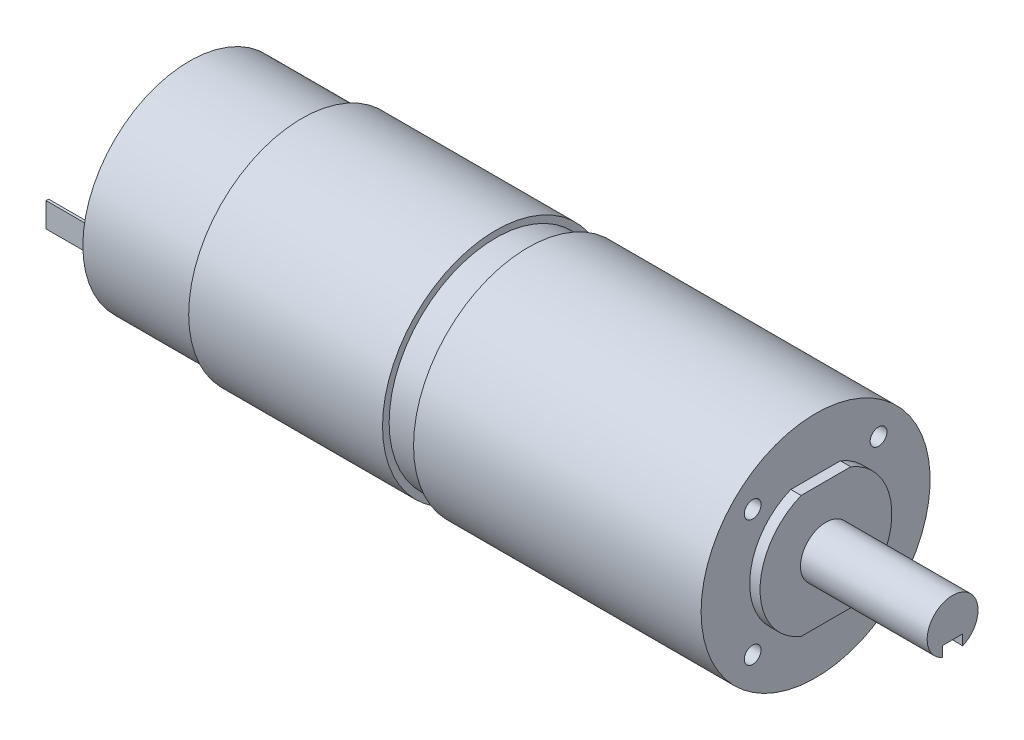
ISO-10303-21;
HEADER;
FILE_DESCRIPTION(('STEP AP214'),'2;1');
FILE_NAME('part.step','',(''),(''),'','','');
FILE_SCHEMA(('AUTOMOTIVE_DESIGN { 1 0 10303 214 1 1 1 1 }'));
ENDSEC;
DATA;
#1=APPLICATION_CONTEXT('core data for automotive mechanical design processes');
#2=APPLICATION_PROTOCOL_DEFINITION('international standard','automotive_design',2000,#1);
#3=PRODUCT_CONTEXT('',#1,'mechanical');
#4=PRODUCT('Part','Part','',(#3));
#5=PRODUCT_RELATED_PRODUCT_CATEGORY('part','',(#4));
#6=PRODUCT_DEFINITION_FORMATION('','',#4);
#7=PRODUCT_DEFINITION_CONTEXT('part definition',#1,'design');
#8=PRODUCT_DEFINITION('design','',#6,#7);
#9=PRODUCT_DEFINITION_SHAPE('','',#8);
#10=(LENGTH_UNIT() NAMED_UNIT(*) SI_UNIT(.MILLI.,.METRE.));
#11=(NAMED_UNIT(*) PLANE_ANGLE_UNIT() SI_UNIT($,.RADIAN.));
#12=(NAMED_UNIT(*) SI_UNIT($,.STERADIAN.) SOLID_ANGLE_UNIT());
#13=UNCERTAINTY_MEASURE_WITH_UNIT(LENGTH_MEASURE(1.E-05),#10,'distance_accuracy_value','');
#14=(GEOMETRIC_REPRESENTATION_CONTEXT(3) GLOBAL_UNCERTAINTY_ASSIGNED_CONTEXT((#13)) GLOBAL_UNIT_ASSIGNED_CONTEXT((#10,
#11,#12)) REPRESENTATION_CONTEXT('',''));
#15=CARTESIAN_POINT('',(0.,0.,0.));
#16=DIRECTION('',(0.,0.,1.));
#17=DIRECTION('',(1.,0.,0.));
#18=AXIS2_PLACEMENT_3D('',#15,#16,#17);
#19=CARTESIAN_POINT('',(9.01699999999997,11.43,0.));
#20=DIRECTION('',(1.,0.,0.));
#21=DIRECTION('',(0.,0.,-1.));
#22=AXIS2_PLACEMENT_3D('',#19,#20,#21);
#23=PLANE('',#22);
#24=DIRECTION('',(0.,1.,0.));
#25=VECTOR('',#24,1.);
#26=CARTESIAN_POINT('',(9.01699999999997,2.413,18.796));
#27=LINE('',#26,#25);
#28=CARTESIAN_POINT('',(9.01699999999997,-2.413,18.796));
#29=VERTEX_POINT('',#28);
#30=CARTESIAN_POINT('',(9.01699999999997,2.413,18.796));
#31=VERTEX_POINT('',#30);
#32=EDGE_CURVE('E186',#29,#31,#27,.T.);
#33=ORIENTED_EDGE('',*,*,#32,.T.);
#34=DIRECTION('',(0.,0.,1.));
#35=VECTOR('',#34,1.);
#36=CARTESIAN_POINT('',(9.01699999999997,2.413,18.796));
#37=LINE('',#36,#35);
#38=CARTESIAN_POINT('',(9.01699999999997,2.413,19.304));
#39=VERTEX_POINT('',#38);
#40=EDGE_CURVE('E197',#31,#39,#37,.T.);
#41=ORIENTED_EDGE('',*,*,#40,.T.);
#42=DIRECTION('',(0.,1.,0.));
#43=VECTOR('',#42,1.);
#44=CARTESIAN_POINT('',(9.01699999999997,2.413,19.304));
#45=LINE('',#44,#43);
#46=CARTESIAN_POINT('',(9.01699999999997,-2.413,19.304));
#47=VERTEX_POINT('',#46);
#48=EDGE_CURVE('E181',#47,#39,#45,.T.);
#49=ORIENTED_EDGE('',*,*,#48,.F.);
#50=DIRECTION('',(0.,0.,1.));
#51=VECTOR('',#50,1.);
#52=CARTESIAN_POINT('',(9.01699999999997,-2.413,18.796));
#53=LINE('',#52,#51);
#54=EDGE_CURVE('E201',#29,#47,#53,.T.);
#55=ORIENTED_EDGE('',*,*,#54,.F.);
#56=EDGE_LOOP('',(#33,#41,#49,#55));
#57=FACE_BOUND('',#56,.T.);
#58=CARTESIAN_POINT('',(9.01699999999997,0.,0.));
#59=DIRECTION('',(-1.,0.,0.));
#60=DIRECTION('',(0.,0.,1.));
#61=AXIS2_PLACEMENT_3D('',#58,#59,#60);
#62=CIRCLE('',#61,11.43);
#63=CARTESIAN_POINT('',(9.01699999999997,0.,11.43));
#64=VERTEX_POINT('',#63);
#65=EDGE_CURVE('E317',#64,#64,#62,.T.);
#66=ORIENTED_EDGE('',*,*,#65,.F.);
#67=EDGE_LOOP('',(#66));
#68=FACE_BOUND('',#67,.T.);
#69=CARTESIAN_POINT('',(9.01699999999997,0.,0.));
#70=DIRECTION('',(-1.,0.,0.));
#71=DIRECTION('',(0.,0.,1.));
#72=AXIS2_PLACEMENT_3D('',#69,#70,#71);
#73=CIRCLE('',#72,20.955);
#74=CARTESIAN_POINT('',(9.01699999999997,0.,20.955));
#75=VERTEX_POINT('',#74);
#76=EDGE_CURVE('E314',#75,#75,#73,.T.);
#77=ORIENTED_EDGE('',*,*,#76,.T.);
#78=EDGE_LOOP('',(#77));
#79=FACE_BOUND('',#78,.T.);
#80=DIRECTION('',(0.,1.,0.));
#81=VECTOR('',#80,1.);
#82=CARTESIAN_POINT('',(9.01699999999997,2.413,-18.796));
#83=LINE('',#82,#81);
#84=CARTESIAN_POINT('',(9.01699999999997,-2.413,-18.796));
#85=VERTEX_POINT('',#84);
#86=CARTESIAN_POINT('',(9.01699999999997,2.413,-18.796));
#87=VERTEX_POINT('',#86);
#88=EDGE_CURVE('E148',#85,#87,#83,.T.);
#89=ORIENTED_EDGE('',*,*,#88,.F.);
#90=DIRECTION('',(0.,0.,-1.));
#91=VECTOR('',#90,1.);
#92=CARTESIAN_POINT('',(9.01699999999997,-2.413,-18.796));
#93=LINE('',#92,#91);
#94=CARTESIAN_POINT('',(9.01699999999997,-2.413,-19.304));
#95=VERTEX_POINT('',#94);
#96=EDGE_CURVE('E169',#85,#95,#93,.T.);
#97=ORIENTED_EDGE('',*,*,#96,.T.);
#98=DIRECTION('',(0.,1.,0.));
#99=VECTOR('',#98,1.);
#100=CARTESIAN_POINT('',(9.01699999999997,2.413,-19.304));
#101=LINE('',#100,#99);
#102=CARTESIAN_POINT('',(9.01699999999997,2.413,-19.304));
#103=VERTEX_POINT('',#102);
#104=EDGE_CURVE('E168',#95,#103,#101,.T.);
#105=ORIENTED_EDGE('',*,*,#104,.T.);
#106=DIRECTION('',(0.,0.,-1.));
#107=VECTOR('',#106,1.);
#108=CARTESIAN_POINT('',(9.01699999999997,2.413,-18.796));
#109=LINE('',#108,#107);
#110=EDGE_CURVE('E162',#87,#103,#109,.T.);
#111=ORIENTED_EDGE('',*,*,#110,.F.);
#112=EDGE_LOOP('',(#89,#97,#105,#111));
#113=FACE_BOUND('',#112,.T.);
#114=ADVANCED_FACE('F32',(#57,#68,#79,#113),#23,.F.);
#115=CARTESIAN_POINT('',(0.,0.,0.));
#116=DIRECTION('',(-1.,0.,0.));
#117=DIRECTION('',(0.,0.,1.));
#118=AXIS2_PLACEMENT_3D('',#115,#116,#117);
#119=CYLINDRICAL_SURFACE('',#118,12.954);
#120=CARTESIAN_POINT('',(134.112,0.,0.));
#121=DIRECTION('',(-1.,0.,0.));
#122=DIRECTION('',(0.,0.,1.));
#123=AXIS2_PLACEMENT_3D('',#120,#121,#122);
#124=CIRCLE('',#123,12.954);
#125=CARTESIAN_POINT('',(134.112,12.0015,-4.87546036287857));
#126=VERTEX_POINT('',#125);
#127=CARTESIAN_POINT('',(134.112,-12.0015,-4.87546036287857));
#128=VERTEX_POINT('',#127);
#129=EDGE_CURVE('E286',#126,#128,#124,.T.);
#130=ORIENTED_EDGE('',*,*,#129,.T.);
#131=DIRECTION('',(1.,0.,0.));
#132=VECTOR('',#131,1.);
#133=CARTESIAN_POINT('',(122.282668156585,-12.0015,-4.87546036287857));
#134=LINE('',#133,#132);
#135=CARTESIAN_POINT('',(132.08,-12.0015,-4.87546036287857));
#136=VERTEX_POINT('',#135);
#137=EDGE_CURVE('E237',#136,#128,#134,.T.);
#138=ORIENTED_EDGE('',*,*,#137,.F.);
#139=CARTESIAN_POINT('',(132.08,0.,0.));
#140=DIRECTION('',(-1.,0.,0.));
#141=DIRECTION('',(0.,0.,1.));
#142=AXIS2_PLACEMENT_3D('',#139,#140,#141);
#143=CIRCLE('',#142,12.954);
#144=CARTESIAN_POINT('',(132.08,12.0015,-4.87546036287857));
#145=VERTEX_POINT('',#144);
#146=EDGE_CURVE('E290',#145,#136,#143,.T.);
#147=ORIENTED_EDGE('',*,*,#146,.F.);
#148=DIRECTION('',(1.,0.,0.));
#149=VECTOR('',#148,1.);
#150=CARTESIAN_POINT('',(122.282668156585,12.0015,-4.87546036287857));
#151=LINE('',#150,#149);
#152=EDGE_CURVE('E244',#145,#126,#151,.T.);
#153=ORIENTED_EDGE('',*,*,#152,.T.);
#154=EDGE_LOOP('',(#130,#138,#147,#153));
#155=FACE_BOUND('',#154,.T.);
#156=ADVANCED_FACE('F342',(#155),#119,.T.);
#157=CARTESIAN_POINT('',(0.,0.,0.));
#158=DIRECTION('',(1.,0.,0.));
#159=DIRECTION('',(0.,0.,-1.));
#160=AXIS2_PLACEMENT_3D('',#157,#158,#159);
#161=PLANE('',#160);
#162=CARTESIAN_POINT('',(0.,0.,0.));
#163=DIRECTION('',(-1.,0.,0.));
#164=DIRECTION('',(0.,0.,1.));
#165=AXIS2_PLACEMENT_3D('',#162,#163,#164);
#166=CIRCLE('',#165,3.81);
#167=CARTESIAN_POINT('',(0.,0.,3.81));
#168=VERTEX_POINT('',#167);
#169=EDGE_CURVE('E11',#168,#168,#166,.T.);
#170=ORIENTED_EDGE('',*,*,#169,.T.);
#171=EDGE_LOOP('',(#170));
#172=FACE_BOUND('',#171,.T.);
#173=ADVANCED_FACE('F34',(#172),#161,.F.);
#174=CARTESIAN_POINT('',(0.,0.,0.));
#175=DIRECTION('',(-1.,0.,0.));
#176=DIRECTION('',(0.,0.,1.));
#177=AXIS2_PLACEMENT_3D('',#174,#175,#176);
#178=CYLINDRICAL_SURFACE('',#177,3.81);
#179=ORIENTED_EDGE('',*,*,#169,.F.);
#180=EDGE_LOOP('',(#179));
#181=FACE_BOUND('',#180,.T.);
#182=CARTESIAN_POINT('',(5.08,0.,0.));
#183=DIRECTION('',(-1.,0.,0.));
#184=DIRECTION('',(0.,0.,1.));
#185=AXIS2_PLACEMENT_3D('',#182,#183,#184);
#186=CIRCLE('',#185,3.81);
#187=CARTESIAN_POINT('',(5.08,0.,3.81));
#188=VERTEX_POINT('',#187);
#189=EDGE_CURVE('E40',#188,#188,#186,.T.);
#190=ORIENTED_EDGE('',*,*,#189,.T.);
#191=EDGE_LOOP('',(#190));
#192=FACE_BOUND('',#191,.T.);
#193=ADVANCED_FACE('F325',(#181,#192),#178,.T.);
#194=CARTESIAN_POINT('',(5.08,3.81,0.));
#195=DIRECTION('',(1.,0.,0.));
#196=DIRECTION('',(0.,0.,-1.));
#197=AXIS2_PLACEMENT_3D('',#194,#195,#196);
#198=PLANE('',#197);
#199=ORIENTED_EDGE('',*,*,#189,.F.);
#200=EDGE_LOOP('',(#199));
#201=FACE_BOUND('',#200,.T.);
#202=CARTESIAN_POINT('',(5.08,0.,0.));
#203=DIRECTION('',(-1.,0.,0.));
#204=DIRECTION('',(0.,0.,1.));
#205=AXIS2_PLACEMENT_3D('',#202,#203,#204);
#206=CIRCLE('',#205,11.43);
#207=CARTESIAN_POINT('',(5.08,0.,11.43));
#208=VERTEX_POINT('',#207);
#209=EDGE_CURVE('E320',#208,#208,#206,.T.);
#210=ORIENTED_EDGE('',*,*,#209,.T.);
#211=EDGE_LOOP('',(#210));
#212=FACE_BOUND('',#211,.T.);
#213=ADVANCED_FACE('F327',(#201,#212),#198,.F.);
#214=CARTESIAN_POINT('',(0.,0.,0.));
#215=DIRECTION('',(-1.,0.,0.));
#216=DIRECTION('',(0.,0.,1.));
#217=AXIS2_PLACEMENT_3D('',#214,#215,#216);
#218=CYLINDRICAL_SURFACE('',#217,11.43);
#219=ORIENTED_EDGE('',*,*,#209,.F.);
#220=EDGE_LOOP('',(#219));
#221=FACE_BOUND('',#220,.T.);
#222=ORIENTED_EDGE('',*,*,#65,.T.);
#223=EDGE_LOOP('',(#222));
#224=FACE_BOUND('',#223,.T.);
#225=ADVANCED_FACE('F330',(#221,#224),#218,.T.);
#226=CARTESIAN_POINT('',(0.,0.,0.));
#227=DIRECTION('',(-1.,0.,0.));
#228=DIRECTION('',(0.,0.,1.));
#229=AXIS2_PLACEMENT_3D('',#226,#227,#228);
#230=CYLINDRICAL_SURFACE('',#229,20.955);
#231=ORIENTED_EDGE('',*,*,#76,.F.);
#232=EDGE_LOOP('',(#231));
#233=FACE_BOUND('',#232,.T.);
#234=CARTESIAN_POINT('',(31.115,0.,0.));
#235=DIRECTION('',(-1.,0.,0.));
#236=DIRECTION('',(0.,0.,1.));
#237=AXIS2_PLACEMENT_3D('',#234,#235,#236);
#238=CIRCLE('',#237,20.955);
#239=CARTESIAN_POINT('',(31.115,0.,20.955));
#240=VERTEX_POINT('',#239);
#241=EDGE_CURVE('E311',#240,#240,#238,.T.);
#242=ORIENTED_EDGE('',*,*,#241,.T.);
#243=EDGE_LOOP('',(#242));
#244=FACE_BOUND('',#243,.T.);
#245=ADVANCED_FACE('F336',(#233,#244),#230,.T.);
#246=CARTESIAN_POINT('',(31.115,20.955,0.));
#247=DIRECTION('',(1.,0.,0.));
#248=DIRECTION('',(0.,0.,-1.));
#249=AXIS2_PLACEMENT_3D('',#246,#247,#248);
#250=PLANE('',#249);
#251=ORIENTED_EDGE('',*,*,#241,.F.);
#252=EDGE_LOOP('',(#251));
#253=FACE_BOUND('',#252,.T.);
#254=CARTESIAN_POINT('',(31.115,0.,0.));
#255=DIRECTION('',(-1.,0.,0.));
#256=DIRECTION('',(0.,0.,1.));
#257=AXIS2_PLACEMENT_3D('',#254,#255,#256);
#258=CIRCLE('',#257,22.2504);
#259=CARTESIAN_POINT('',(31.115,0.,22.2504));
#260=VERTEX_POINT('',#259);
#261=EDGE_CURVE('E308',#260,#260,#258,.T.);
#262=ORIENTED_EDGE('',*,*,#261,.T.);
#263=EDGE_LOOP('',(#262));
#264=FACE_BOUND('',#263,.T.);
#265=ADVANCED_FACE('F349',(#253,#264),#250,.F.);
#266=CARTESIAN_POINT('',(0.,0.,0.));
#267=DIRECTION('',(-1.,0.,0.));
#268=DIRECTION('',(0.,0.,1.));
#269=AXIS2_PLACEMENT_3D('',#266,#267,#268);
#270=CYLINDRICAL_SURFACE('',#269,22.2504);
#271=ORIENTED_EDGE('',*,*,#261,.F.);
#272=EDGE_LOOP('',(#271));
#273=FACE_BOUND('',#272,.T.);
#274=CARTESIAN_POINT('',(69.215,0.,0.));
#275=DIRECTION('',(-1.,0.,0.));
#276=DIRECTION('',(0.,0.,1.));
#277=AXIS2_PLACEMENT_3D('',#274,#275,#276);
#278=CIRCLE('',#277,22.2504);
#279=CARTESIAN_POINT('',(69.215,0.,22.2504));
#280=VERTEX_POINT('',#279);
#281=EDGE_CURVE('E305',#280,#280,#278,.T.);
#282=ORIENTED_EDGE('',*,*,#281,.T.);
#283=EDGE_LOOP('',(#282));
#284=FACE_BOUND('',#283,.T.);
#285=ADVANCED_FACE('F355',(#273,#284),#270,.T.);
#286=CARTESIAN_POINT('',(69.215,22.2504,0.));
#287=DIRECTION('',(-1.,0.,0.));
#288=DIRECTION('',(0.,0.,1.));
#289=AXIS2_PLACEMENT_3D('',#286,#287,#288);
#290=PLANE('',#289);
#291=ORIENTED_EDGE('',*,*,#281,.F.);
#292=EDGE_LOOP('',(#291));
#293=FACE_BOUND('',#292,.T.);
#294=CARTESIAN_POINT('',(69.215,0.,0.));
#295=DIRECTION('',(-1.,0.,0.));
#296=DIRECTION('',(0.,0.,1.));
#297=AXIS2_PLACEMENT_3D('',#294,#295,#296);
#298=CIRCLE('',#297,20.955);
#299=CARTESIAN_POINT('',(69.215,0.,20.955));
#300=VERTEX_POINT('',#299);
#301=EDGE_CURVE('E302',#300,#300,#298,.T.);
#302=ORIENTED_EDGE('',*,*,#301,.T.);
#303=EDGE_LOOP('',(#302));
#304=FACE_BOUND('',#303,.T.);
#305=ADVANCED_FACE('F361',(#293,#304),#290,.F.);
#306=CARTESIAN_POINT('',(0.,0.,0.));
#307=DIRECTION('',(-1.,0.,0.));
#308=DIRECTION('',(0.,0.,1.));
#309=AXIS2_PLACEMENT_3D('',#306,#307,#308);
#310=CYLINDRICAL_SURFACE('',#309,20.955);
#311=ORIENTED_EDGE('',*,*,#301,.F.);
#312=EDGE_LOOP('',(#311));
#313=FACE_BOUND('',#312,.T.);
#314=CARTESIAN_POINT('',(75.565,0.,0.));
#315=DIRECTION('',(-1.,0.,0.));
#316=DIRECTION('',(0.,0.,1.));
#317=AXIS2_PLACEMENT_3D('',#314,#315,#316);
#318=CIRCLE('',#317,20.955);
#319=CARTESIAN_POINT('',(75.565,0.,20.955));
#320=VERTEX_POINT('',#319);
#321=EDGE_CURVE('E299',#320,#320,#318,.T.);
#322=ORIENTED_EDGE('',*,*,#321,.T.);
#323=EDGE_LOOP('',(#322));
#324=FACE_BOUND('',#323,.T.);
#325=ADVANCED_FACE('F367',(#313,#324),#310,.T.);
#326=CARTESIAN_POINT('',(75.565,20.955,0.));
#327=DIRECTION('',(1.,0.,0.));
#328=DIRECTION('',(0.,0.,-1.));
#329=AXIS2_PLACEMENT_3D('',#326,#327,#328);
#330=PLANE('',#329);
#331=ORIENTED_EDGE('',*,*,#321,.F.);
#332=EDGE_LOOP('',(#331));
#333=FACE_BOUND('',#332,.T.);
#334=CARTESIAN_POINT('',(75.565,0.,0.));
#335=DIRECTION('',(-1.,0.,0.));
#336=DIRECTION('',(0.,0.,1.));
#337=AXIS2_PLACEMENT_3D('',#334,#335,#336);
#338=CIRCLE('',#337,22.5044);
#339=CARTESIAN_POINT('',(75.565,0.,22.5044));
#340=VERTEX_POINT('',#339);
#341=EDGE_CURVE('E296',#340,#340,#338,.T.);
#342=ORIENTED_EDGE('',*,*,#341,.T.);
#343=EDGE_LOOP('',(#342));
#344=FACE_BOUND('',#343,.T.);
#345=ADVANCED_FACE('F373',(#333,#344),#330,.F.);
#346=CARTESIAN_POINT('',(0.,0.,0.));
#347=DIRECTION('',(-1.,0.,0.));
#348=DIRECTION('',(0.,0.,1.));
#349=AXIS2_PLACEMENT_3D('',#346,#347,#348);
#350=CYLINDRICAL_SURFACE('',#349,22.5044);
#351=ORIENTED_EDGE('',*,*,#341,.F.);
#352=EDGE_LOOP('',(#351));
#353=FACE_BOUND('',#352,.T.);
#354=CARTESIAN_POINT('',(132.08,0.,0.));
#355=DIRECTION('',(-1.,0.,0.));
#356=DIRECTION('',(0.,0.,1.));
#357=AXIS2_PLACEMENT_3D('',#354,#355,#356);
#358=CIRCLE('',#357,22.5044);
#359=CARTESIAN_POINT('',(132.08,0.,22.5044));
#360=VERTEX_POINT('',#359);
#361=EDGE_CURVE('E293',#360,#360,#358,.T.);
#362=ORIENTED_EDGE('',*,*,#361,.T.);
#363=EDGE_LOOP('',(#362));
#364=FACE_BOUND('',#363,.T.);
#365=ADVANCED_FACE('F379',(#353,#364),#350,.T.);
#366=CARTESIAN_POINT('',(132.08,22.5044,0.));
#367=DIRECTION('',(-1.,0.,0.));
#368=DIRECTION('',(0.,0.,1.));
#369=AXIS2_PLACEMENT_3D('',#366,#367,#368);
#370=PLANE('',#369);
#371=CARTESIAN_POINT('',(132.08,12.3747929348333,12.3747929348333));
#372=DIRECTION('',(1.,0.,0.));
#373=DIRECTION('',(0.,0.,-1.));
#374=AXIS2_PLACEMENT_3D('',#371,#372,#373);
#375=CIRCLE('',#374,1.65);
#376=CARTESIAN_POINT('',(132.08,12.3747929348333,10.7247929348333));
#377=VERTEX_POINT('',#376);
#378=EDGE_CURVE('E200',#377,#377,#375,.T.);
#379=ORIENTED_EDGE('',*,*,#378,.F.);
#380=EDGE_LOOP('',(#379));
#381=FACE_BOUND('',#380,.T.);
#382=CARTESIAN_POINT('',(132.08,-12.3747929348333,-12.3747929348333));
#383=DIRECTION('',(1.,0.,0.));
#384=DIRECTION('',(0.,0.,-1.));
#385=AXIS2_PLACEMENT_3D('',#382,#383,#384);
#386=CIRCLE('',#385,1.65);
#387=CARTESIAN_POINT('',(132.08,-12.3747929348333,-14.0247929348333));
#388=VERTEX_POINT('',#387);
#389=EDGE_CURVE('E211',#388,#388,#386,.T.);
#390=ORIENTED_EDGE('',*,*,#389,.F.);
#391=EDGE_LOOP('',(#390));
#392=FACE_BOUND('',#391,.T.);
#393=CARTESIAN_POINT('',(132.08,12.3747929348333,-12.3747929348333));
#394=DIRECTION('',(1.,0.,0.));
#395=DIRECTION('',(0.,0.,-1.));
#396=AXIS2_PLACEMENT_3D('',#393,#394,#395);
#397=CIRCLE('',#396,1.65);
#398=CARTESIAN_POINT('',(132.08,12.3747929348333,-14.0247929348333));
#399=VERTEX_POINT('',#398);
#400=EDGE_CURVE('E217',#399,#399,#397,.T.);
#401=ORIENTED_EDGE('',*,*,#400,.F.);
#402=EDGE_LOOP('',(#401));
#403=FACE_BOUND('',#402,.T.);
#404=CARTESIAN_POINT('',(132.08,-12.3747929348333,12.3747929348333));
#405=DIRECTION('',(1.,0.,0.));
#406=DIRECTION('',(0.,0.,-1.));
#407=AXIS2_PLACEMENT_3D('',#404,#405,#406);
#408=CIRCLE('',#407,1.65);
#409=CARTESIAN_POINT('',(132.08,-12.3747929348333,10.7247929348333));
#410=VERTEX_POINT('',#409);
#411=EDGE_CURVE('E223',#410,#410,#408,.T.);
#412=ORIENTED_EDGE('',*,*,#411,.F.);
#413=EDGE_LOOP('',(#412));
#414=FACE_BOUND('',#413,.T.);
#415=ORIENTED_EDGE('',*,*,#361,.F.);
#416=EDGE_LOOP('',(#415));
#417=FACE_BOUND('',#416,.T.);
#418=ORIENTED_EDGE('',*,*,#146,.T.);
#419=DIRECTION('',(0.,0.,1.));
#420=VECTOR('',#419,1.);
#421=CARTESIAN_POINT('',(132.08,-12.0015,4.87546036287857));
#422=LINE('',#421,#420);
#423=CARTESIAN_POINT('',(132.08,-12.0015,4.87546036287857));
#424=VERTEX_POINT('',#423);
#425=EDGE_CURVE('E231',#136,#424,#422,.T.);
#426=ORIENTED_EDGE('',*,*,#425,.T.);
#427=CARTESIAN_POINT('',(132.08,12.0015,4.87546036287857));
#428=VERTEX_POINT('',#427);
#429=EDGE_CURVE('E289',#424,#428,#143,.T.);
#430=ORIENTED_EDGE('',*,*,#429,.T.);
#431=DIRECTION('',(0.,0.,-1.));
#432=VECTOR('',#431,1.);
#433=CARTESIAN_POINT('',(132.08,12.0015,4.87546036287857));
#434=LINE('',#433,#432);
#435=EDGE_CURVE('E241',#428,#145,#434,.T.);
#436=ORIENTED_EDGE('',*,*,#435,.T.);
#437=EDGE_LOOP('',(#418,#426,#430,#436));
#438=FACE_BOUND('',#437,.T.);
#439=ADVANCED_FACE('F385',(#381,#392,#403,#414,#417,#438),#370,.F.);
#440=ORIENTED_EDGE('',*,*,#429,.F.);
#441=DIRECTION('',(1.,0.,0.));
#442=VECTOR('',#441,1.);
#443=CARTESIAN_POINT('',(122.282668156585,-12.0015,4.87546036287857));
#444=LINE('',#443,#442);
#445=CARTESIAN_POINT('',(134.112,-12.0015,4.87546036287857));
#446=VERTEX_POINT('',#445);
#447=EDGE_CURVE('E234',#424,#446,#444,.T.);
#448=ORIENTED_EDGE('',*,*,#447,.T.);
#449=CARTESIAN_POINT('',(134.112,12.0015,4.87546036287857));
#450=VERTEX_POINT('',#449);
#451=EDGE_CURVE('E285',#446,#450,#124,.T.);
#452=ORIENTED_EDGE('',*,*,#451,.T.);
#453=DIRECTION('',(1.,0.,0.));
#454=VECTOR('',#453,1.);
#455=CARTESIAN_POINT('',(122.282668156585,12.0015,4.87546036287857));
#456=LINE('',#455,#454);
#457=EDGE_CURVE('E247',#428,#450,#456,.T.);
#458=ORIENTED_EDGE('',*,*,#457,.F.);
#459=EDGE_LOOP('',(#440,#448,#452,#458));
#460=FACE_BOUND('',#459,.T.);
#461=ADVANCED_FACE('F391',(#460),#119,.T.);
#462=CARTESIAN_POINT('',(134.112,12.954,0.));
#463=DIRECTION('',(-1.,0.,0.));
#464=DIRECTION('',(0.,0.,1.));
#465=AXIS2_PLACEMENT_3D('',#462,#463,#464);
#466=PLANE('',#465);
#467=ORIENTED_EDGE('',*,*,#451,.F.);
#468=DIRECTION('',(0.,0.,1.));
#469=VECTOR('',#468,1.);
#470=CARTESIAN_POINT('',(134.112,-12.0015,4.87546036287857));
#471=LINE('',#470,#469);
#472=EDGE_CURVE('E229',#128,#446,#471,.T.);
#473=ORIENTED_EDGE('',*,*,#472,.F.);
#474=ORIENTED_EDGE('',*,*,#129,.F.);
#475=DIRECTION('',(0.,0.,-1.));
#476=VECTOR('',#475,1.);
#477=CARTESIAN_POINT('',(134.112,12.0015,4.87546036287857));
#478=LINE('',#477,#476);
#479=EDGE_CURVE('E239',#450,#126,#478,.T.);
#480=ORIENTED_EDGE('',*,*,#479,.F.);
#481=EDGE_LOOP('',(#467,#473,#474,#480));
#482=FACE_BOUND('',#481,.T.);
#483=CARTESIAN_POINT('',(134.112,0.,0.));
#484=DIRECTION('',(-1.,0.,0.));
#485=DIRECTION('',(0.,0.,1.));
#486=AXIS2_PLACEMENT_3D('',#483,#484,#485);
#487=CIRCLE('',#486,4.99999);
#488=CARTESIAN_POINT('',(134.112,0.,4.99999));
#489=VERTEX_POINT('',#488);
#490=EDGE_CURVE('E282',#489,#489,#487,.T.);
#491=ORIENTED_EDGE('',*,*,#490,.T.);
#492=EDGE_LOOP('',(#491));
#493=FACE_BOUND('',#492,.T.);
#494=ADVANCED_FACE('F405',(#482,#493),#466,.F.);
#495=CARTESIAN_POINT('',(0.,0.,0.));
#496=DIRECTION('',(-1.,0.,0.));
#497=DIRECTION('',(0.,0.,1.));
#498=AXIS2_PLACEMENT_3D('',#495,#496,#497);
#499=CYLINDRICAL_SURFACE('',#498,4.99999);
#500=CARTESIAN_POINT('',(159.004,0.,0.));
#501=DIRECTION('',(-1.,0.,0.));
#502=DIRECTION('',(0.,0.,1.));
#503=AXIS2_PLACEMENT_3D('',#500,#501,#502);
#504=CIRCLE('',#503,4.99999);
#505=CARTESIAN_POINT('',(159.004,-4.58522221818092,1.9939));
#506=VERTEX_POINT('',#505);
#507=CARTESIAN_POINT('',(159.004,-4.58522221818093,-1.9939));
#508=VERTEX_POINT('',#507);
#509=EDGE_CURVE('E272',#506,#508,#504,.T.);
#510=ORIENTED_EDGE('',*,*,#509,.T.);
#511=DIRECTION('',(1.,0.,0.));
#512=VECTOR('',#511,1.);
#513=CARTESIAN_POINT('',(140.9954,-4.58522221818093,-1.9939));
#514=LINE('',#513,#512);
#515=CARTESIAN_POINT('',(140.9954,-4.58522221818093,-1.9939));
#516=VERTEX_POINT('',#515);
#517=EDGE_CURVE('E270',#516,#508,#514,.T.);
#518=ORIENTED_EDGE('',*,*,#517,.F.);
#519=CARTESIAN_POINT('',(140.9954,0.,0.));
#520=DIRECTION('',(1.,0.,0.));
#521=DIRECTION('',(0.,0.,-1.));
#522=AXIS2_PLACEMENT_3D('',#519,#520,#521);
#523=CIRCLE('',#522,4.99999);
#524=CARTESIAN_POINT('',(140.9954,-4.58522221818092,1.9939));
#525=VERTEX_POINT('',#524);
#526=EDGE_CURVE('E261',#525,#516,#523,.T.);
#527=ORIENTED_EDGE('',*,*,#526,.F.);
#528=DIRECTION('',(1.,0.,0.));
#529=VECTOR('',#528,1.);
#530=CARTESIAN_POINT('',(140.9954,-4.58522221818092,1.9939));
#531=LINE('',#530,#529);
#532=EDGE_CURVE('E273',#525,#506,#531,.T.);
#533=ORIENTED_EDGE('',*,*,#532,.T.);
#534=EDGE_LOOP('',(#510,#518,#527,#533));
#535=FACE_BOUND('',#534,.T.);
#536=ORIENTED_EDGE('',*,*,#490,.F.);
#537=EDGE_LOOP('',(#536));
#538=FACE_BOUND('',#537,.T.);
#539=ADVANCED_FACE('F440',(#535,#538),#499,.T.);
#540=CARTESIAN_POINT('',(159.004,4.99999,0.));
#541=DIRECTION('',(-1.,0.,0.));
#542=DIRECTION('',(0.,0.,1.));
#543=AXIS2_PLACEMENT_3D('',#540,#541,#542);
#544=PLANE('',#543);
#545=DIRECTION('',(0.,0.,1.));
#546=VECTOR('',#545,1.);
#547=CARTESIAN_POINT('',(159.004,-2.55322221818092,1.9939));
#548=LINE('',#547,#546);
#549=CARTESIAN_POINT('',(159.004,-2.55322221818092,-1.9939));
#550=VERTEX_POINT('',#549);
#551=CARTESIAN_POINT('',(159.004,-2.55322221818092,1.9939));
#552=VERTEX_POINT('',#551);
#553=EDGE_CURVE('E266',#550,#552,#548,.T.);
#554=ORIENTED_EDGE('',*,*,#553,.F.);
#555=DIRECTION('',(0.,1.,0.));
#556=VECTOR('',#555,1.);
#557=CARTESIAN_POINT('',(159.004,-4.58522221818092,-1.9939));
#558=LINE('',#557,#556);
#559=EDGE_CURVE('E250',#508,#550,#558,.T.);
#560=ORIENTED_EDGE('',*,*,#559,.F.);
#561=ORIENTED_EDGE('',*,*,#509,.F.);
#562=DIRECTION('',(0.,-1.,0.));
#563=VECTOR('',#562,1.);
#564=CARTESIAN_POINT('',(159.004,-4.58522221818092,1.9939));
#565=LINE('',#564,#563);
#566=EDGE_CURVE('E255',#552,#506,#565,.T.);
#567=ORIENTED_EDGE('',*,*,#566,.F.);
#568=EDGE_LOOP('',(#554,#560,#561,#567));
#569=FACE_BOUND('',#568,.T.);
#570=ADVANCED_FACE('F436',(#569),#544,.F.);
#571=CARTESIAN_POINT('',(140.9954,-4.58522221818092,-1.9939));
#572=DIRECTION('',(0.,0.,-1.));
#573=DIRECTION('',(-1.,0.,0.));
#574=AXIS2_PLACEMENT_3D('',#571,#572,#573);
#575=PLANE('',#574);
#576=ORIENTED_EDGE('',*,*,#559,.T.);
#577=DIRECTION('',(1.,0.,0.));
#578=VECTOR('',#577,1.);
#579=CARTESIAN_POINT('',(140.9954,-2.55322221818092,-1.9939));
#580=LINE('',#579,#578);
#581=CARTESIAN_POINT('',(140.9954,-2.55322221818092,-1.9939));
#582=VERTEX_POINT('',#581);
#583=EDGE_CURVE('E264',#582,#550,#580,.T.);
#584=ORIENTED_EDGE('',*,*,#583,.F.);
#585=DIRECTION('',(0.,1.,0.));
#586=VECTOR('',#585,1.);
#587=CARTESIAN_POINT('',(140.9954,-4.58522221818092,-1.9939));
#588=LINE('',#587,#586);
#589=EDGE_CURVE('E251',#516,#582,#588,.T.);
#590=ORIENTED_EDGE('',*,*,#589,.F.);
#591=ORIENTED_EDGE('',*,*,#517,.T.);
#592=EDGE_LOOP('',(#576,#584,#590,#591));
#593=FACE_BOUND('',#592,.T.);
#594=ADVANCED_FACE('F429',(#593),#575,.F.);
#595=CARTESIAN_POINT('',(140.9954,-4.58522221818092,1.9939));
#596=DIRECTION('',(0.,0.,1.));
#597=DIRECTION('',(1.,0.,0.));
#598=AXIS2_PLACEMENT_3D('',#595,#596,#597);
#599=PLANE('',#598);
#600=ORIENTED_EDGE('',*,*,#566,.T.);
#601=ORIENTED_EDGE('',*,*,#532,.F.);
#602=DIRECTION('',(0.,-1.,0.));
#603=VECTOR('',#602,1.);
#604=CARTESIAN_POINT('',(140.9954,-4.58522221818092,1.9939));
#605=LINE('',#604,#603);
#606=CARTESIAN_POINT('',(140.9954,-2.55322221818092,1.9939));
#607=VERTEX_POINT('',#606);
#608=EDGE_CURVE('E258',#607,#525,#605,.T.);
#609=ORIENTED_EDGE('',*,*,#608,.F.);
#610=DIRECTION('',(1.,0.,0.));
#611=VECTOR('',#610,1.);
#612=CARTESIAN_POINT('',(140.9954,-2.55322221818092,1.9939));
#613=LINE('',#612,#611);
#614=EDGE_CURVE('E276',#607,#552,#613,.T.);
#615=ORIENTED_EDGE('',*,*,#614,.T.);
#616=EDGE_LOOP('',(#600,#601,#609,#615));
#617=FACE_BOUND('',#616,.T.);
#618=ADVANCED_FACE('F426',(#617),#599,.F.);
#619=CARTESIAN_POINT('',(140.9954,-2.55322221818092,1.9939));
#620=DIRECTION('',(0.,1.,0.));
#621=DIRECTION('',(0.,0.,1.));
#622=AXIS2_PLACEMENT_3D('',#619,#620,#621);
#623=PLANE('',#622);
#624=ORIENTED_EDGE('',*,*,#553,.T.);
#625=ORIENTED_EDGE('',*,*,#614,.F.);
#626=DIRECTION('',(0.,0.,1.));
#627=VECTOR('',#626,1.);
#628=CARTESIAN_POINT('',(140.9954,-2.55322221818092,1.9939));
#629=LINE('',#628,#627);
#630=EDGE_CURVE('E254',#582,#607,#629,.T.);
#631=ORIENTED_EDGE('',*,*,#630,.F.);
#632=ORIENTED_EDGE('',*,*,#583,.T.);
#633=EDGE_LOOP('',(#624,#625,#631,#632));
#634=FACE_BOUND('',#633,.T.);
#635=ADVANCED_FACE('F421',(#634),#623,.F.);
#636=CARTESIAN_POINT('',(140.9954,0.,0.));
#637=DIRECTION('',(1.,0.,0.));
#638=DIRECTION('',(0.,0.,-1.));
#639=AXIS2_PLACEMENT_3D('',#636,#637,#638);
#640=PLANE('',#639);
#641=ORIENTED_EDGE('',*,*,#589,.T.);
#642=ORIENTED_EDGE('',*,*,#630,.T.);
#643=ORIENTED_EDGE('',*,*,#608,.T.);
#644=ORIENTED_EDGE('',*,*,#526,.T.);
#645=EDGE_LOOP('',(#641,#642,#643,#644));
#646=FACE_BOUND('',#645,.T.);
#647=ADVANCED_FACE('F413',(#646),#640,.T.);
#648=CARTESIAN_POINT('',(122.282668156585,12.0015,4.87546036287857));
#649=DIRECTION('',(0.,-1.,0.));
#650=DIRECTION('',(0.,0.,-1.));
#651=AXIS2_PLACEMENT_3D('',#648,#649,#650);
#652=PLANE('',#651);
#653=ORIENTED_EDGE('',*,*,#457,.T.);
#654=ORIENTED_EDGE('',*,*,#479,.T.);
#655=ORIENTED_EDGE('',*,*,#152,.F.);
#656=ORIENTED_EDGE('',*,*,#435,.F.);
#657=EDGE_LOOP('',(#653,#654,#655,#656));
#658=FACE_BOUND('',#657,.T.);
#659=ADVANCED_FACE('F411',(#658),#652,.F.);
#660=CARTESIAN_POINT('',(122.282668156585,-12.0015,4.87546036287857));
#661=DIRECTION('',(0.,1.,0.));
#662=DIRECTION('',(0.,0.,1.));
#663=AXIS2_PLACEMENT_3D('',#660,#661,#662);
#664=PLANE('',#663);
#665=ORIENTED_EDGE('',*,*,#137,.T.);
#666=ORIENTED_EDGE('',*,*,#472,.T.);
#667=ORIENTED_EDGE('',*,*,#447,.F.);
#668=ORIENTED_EDGE('',*,*,#425,.F.);
#669=EDGE_LOOP('',(#665,#666,#667,#668));
#670=FACE_BOUND('',#669,.T.);
#671=ADVANCED_FACE('F402',(#670),#664,.F.);
#672=CARTESIAN_POINT('',(119.38,-12.3747929348333,12.3747929348333));
#673=DIRECTION('',(-1.,0.,0.));
#674=DIRECTION('',(0.,0.,1.));
#675=AXIS2_PLACEMENT_3D('',#672,#673,#674);
#676=PLANE('',#675);
#677=CARTESIAN_POINT('',(119.38,-12.3747929348333,12.3747929348333));
#678=DIRECTION('',(1.,0.,0.));
#679=DIRECTION('',(0.,0.,-1.));
#680=AXIS2_PLACEMENT_3D('',#677,#678,#679);
#681=CIRCLE('',#680,1.65);
#682=CARTESIAN_POINT('',(119.38,-12.3747929348333,10.7247929348333));
#683=VERTEX_POINT('',#682);
#684=EDGE_CURVE('E226',#683,#683,#681,.T.);
#685=ORIENTED_EDGE('',*,*,#684,.T.);
#686=EDGE_LOOP('',(#685));
#687=FACE_BOUND('',#686,.T.);
#688=ADVANCED_FACE('F419',(#687),#676,.F.);
#689=CARTESIAN_POINT('',(132.08,-12.3747929348333,12.3747929348333));
#690=DIRECTION('',(1.,0.,0.));
#691=DIRECTION('',(0.,0.,-1.));
#692=AXIS2_PLACEMENT_3D('',#689,#690,#691);
#693=CYLINDRICAL_SURFACE('',#692,1.65);
#694=ORIENTED_EDGE('',*,*,#684,.F.);
#695=EDGE_LOOP('',(#694));
#696=FACE_BOUND('',#695,.T.);
#697=ORIENTED_EDGE('',*,*,#411,.T.);
#698=EDGE_LOOP('',(#697));
#699=FACE_BOUND('',#698,.T.);
#700=ADVANCED_FACE('F562',(#696,#699),#693,.F.);
#701=CARTESIAN_POINT('',(119.38,12.3747929348333,-12.3747929348333));
#702=DIRECTION('',(-1.,0.,0.));
#703=DIRECTION('',(0.,0.,1.));
#704=AXIS2_PLACEMENT_3D('',#701,#702,#703);
#705=PLANE('',#704);
#706=CARTESIAN_POINT('',(119.38,12.3747929348333,-12.3747929348333));
#707=DIRECTION('',(1.,0.,0.));
#708=DIRECTION('',(0.,0.,-1.));
#709=AXIS2_PLACEMENT_3D('',#706,#707,#708);
#710=CIRCLE('',#709,1.65);
#711=CARTESIAN_POINT('',(119.38,12.3747929348333,-14.0247929348333));
#712=VERTEX_POINT('',#711);
#713=EDGE_CURVE('E220',#712,#712,#710,.T.);
#714=ORIENTED_EDGE('',*,*,#713,.T.);
#715=EDGE_LOOP('',(#714));
#716=FACE_BOUND('',#715,.T.);
#717=ADVANCED_FACE('F558',(#716),#705,.F.);
#718=CARTESIAN_POINT('',(132.08,12.3747929348333,-12.3747929348333));
#719=DIRECTION('',(1.,0.,0.));
#720=DIRECTION('',(0.,0.,-1.));
#721=AXIS2_PLACEMENT_3D('',#718,#719,#720);
#722=CYLINDRICAL_SURFACE('',#721,1.65);
#723=ORIENTED_EDGE('',*,*,#713,.F.);
#724=EDGE_LOOP('',(#723));
#725=FACE_BOUND('',#724,.T.);
#726=ORIENTED_EDGE('',*,*,#400,.T.);
#727=EDGE_LOOP('',(#726));
#728=FACE_BOUND('',#727,.T.);
#729=ADVANCED_FACE('F554',(#725,#728),#722,.F.);
#730=CARTESIAN_POINT('',(119.38,-12.3747929348333,-12.3747929348333));
#731=DIRECTION('',(-1.,0.,0.));
#732=DIRECTION('',(0.,0.,1.));
#733=AXIS2_PLACEMENT_3D('',#730,#731,#732);
#734=PLANE('',#733);
#735=CARTESIAN_POINT('',(119.38,-12.3747929348333,-12.3747929348333));
#736=DIRECTION('',(1.,0.,0.));
#737=DIRECTION('',(0.,0.,-1.));
#738=AXIS2_PLACEMENT_3D('',#735,#736,#737);
#739=CIRCLE('',#738,1.65);
#740=CARTESIAN_POINT('',(119.38,-12.3747929348333,-14.0247929348333));
#741=VERTEX_POINT('',#740);
#742=EDGE_CURVE('E214',#741,#741,#739,.T.);
#743=ORIENTED_EDGE('',*,*,#742,.T.);
#744=EDGE_LOOP('',(#743));
#745=FACE_BOUND('',#744,.T.);
#746=ADVANCED_FACE('F550',(#745),#734,.F.);
#747=CARTESIAN_POINT('',(132.08,-12.3747929348333,-12.3747929348333));
#748=DIRECTION('',(1.,0.,0.));
#749=DIRECTION('',(0.,0.,-1.));
#750=AXIS2_PLACEMENT_3D('',#747,#748,#749);
#751=CYLINDRICAL_SURFACE('',#750,1.65);
#752=ORIENTED_EDGE('',*,*,#742,.F.);
#753=EDGE_LOOP('',(#752));
#754=FACE_BOUND('',#753,.T.);
#755=ORIENTED_EDGE('',*,*,#389,.T.);
#756=EDGE_LOOP('',(#755));
#757=FACE_BOUND('',#756,.T.);
#758=ADVANCED_FACE('F546',(#754,#757),#751,.F.);
#759=CARTESIAN_POINT('',(119.38,12.3747929348333,12.3747929348333));
#760=DIRECTION('',(-1.,0.,0.));
#761=DIRECTION('',(0.,0.,1.));
#762=AXIS2_PLACEMENT_3D('',#759,#760,#761);
#763=PLANE('',#762);
#764=CARTESIAN_POINT('',(119.38,12.3747929348333,12.3747929348333));
#765=DIRECTION('',(1.,0.,0.));
#766=DIRECTION('',(0.,0.,-1.));
#767=AXIS2_PLACEMENT_3D('',#764,#765,#766);
#768=CIRCLE('',#767,1.65);
#769=CARTESIAN_POINT('',(119.38,12.3747929348333,10.7247929348333));
#770=VERTEX_POINT('',#769);
#771=EDGE_CURVE('E208',#770,#770,#768,.T.);
#772=ORIENTED_EDGE('',*,*,#771,.T.);
#773=EDGE_LOOP('',(#772));
#774=FACE_BOUND('',#773,.T.);
#775=ADVANCED_FACE('F542',(#774),#763,.F.);
#776=CARTESIAN_POINT('',(132.08,12.3747929348333,12.3747929348333));
#777=DIRECTION('',(1.,0.,0.));
#778=DIRECTION('',(0.,0.,-1.));
#779=AXIS2_PLACEMENT_3D('',#776,#777,#778);
#780=CYLINDRICAL_SURFACE('',#779,1.65);
#781=ORIENTED_EDGE('',*,*,#771,.F.);
#782=EDGE_LOOP('',(#781));
#783=FACE_BOUND('',#782,.T.);
#784=ORIENTED_EDGE('',*,*,#378,.T.);
#785=EDGE_LOOP('',(#784));
#786=FACE_BOUND('',#785,.T.);
#787=ADVANCED_FACE('F538',(#783,#786),#780,.F.);
#788=CARTESIAN_POINT('',(9.01699999999997,2.413,18.796));
#789=DIRECTION('',(0.,1.,0.));
#790=DIRECTION('',(-1.,0.,0.));
#791=AXIS2_PLACEMENT_3D('',#788,#789,#790);
#792=PLANE('',#791);
#793=DIRECTION('',(-1.,0.,0.));
#794=VECTOR('',#793,1.);
#795=CARTESIAN_POINT('',(9.01699999999997,2.413,19.304));
#796=LINE('',#795,#794);
#797=CARTESIAN_POINT('',(0.126999999999973,2.413,19.304));
#798=VERTEX_POINT('',#797);
#799=EDGE_CURVE('E190',#39,#798,#796,.T.);
#800=ORIENTED_EDGE('',*,*,#799,.F.);
#801=ORIENTED_EDGE('',*,*,#40,.F.);
#802=DIRECTION('',(-1.,0.,0.));
#803=VECTOR('',#802,1.);
#804=CARTESIAN_POINT('',(9.01699999999997,2.413,18.796));
#805=LINE('',#804,#803);
#806=CARTESIAN_POINT('',(0.126999999999973,2.413,18.796));
#807=VERTEX_POINT('',#806);
#808=EDGE_CURVE('E177',#31,#807,#805,.T.);
#809=ORIENTED_EDGE('',*,*,#808,.T.);
#810=DIRECTION('',(0.,0.,1.));
#811=VECTOR('',#810,1.);
#812=CARTESIAN_POINT('',(0.126999999999973,2.413,18.796));
#813=LINE('',#812,#811);
#814=EDGE_CURVE('E189',#807,#798,#813,.T.);
#815=ORIENTED_EDGE('',*,*,#814,.T.);
#816=EDGE_LOOP('',(#800,#801,#809,#815));
#817=FACE_BOUND('',#816,.T.);
#818=ADVANCED_FACE('F531',(#817),#792,.T.);
#819=CARTESIAN_POINT('',(0.126999999999973,-2.413,18.796));
#820=DIRECTION('',(0.,-1.,0.));
#821=DIRECTION('',(0.,0.,-1.));
#822=AXIS2_PLACEMENT_3D('',#819,#820,#821);
#823=PLANE('',#822);
#824=DIRECTION('',(1.,0.,0.));
#825=VECTOR('',#824,1.);
#826=CARTESIAN_POINT('',(0.126999999999973,-2.413,19.304));
#827=LINE('',#826,#825);
#828=CARTESIAN_POINT('',(0.126999999999973,-2.413,19.304));
#829=VERTEX_POINT('',#828);
#830=EDGE_CURVE('E55',#829,#47,#827,.T.);
#831=ORIENTED_EDGE('',*,*,#830,.F.);
#832=DIRECTION('',(0.,0.,1.));
#833=VECTOR('',#832,1.);
#834=CARTESIAN_POINT('',(0.126999999999973,-2.413,18.796));
#835=LINE('',#834,#833);
#836=CARTESIAN_POINT('',(0.126999999999973,-2.413,18.796));
#837=VERTEX_POINT('',#836);
#838=EDGE_CURVE('E203',#837,#829,#835,.T.);
#839=ORIENTED_EDGE('',*,*,#838,.F.);
#840=DIRECTION('',(1.,0.,0.));
#841=VECTOR('',#840,1.);
#842=CARTESIAN_POINT('',(0.126999999999973,-2.413,18.796));
#843=LINE('',#842,#841);
#844=EDGE_CURVE('E184',#837,#29,#843,.T.);
#845=ORIENTED_EDGE('',*,*,#844,.T.);
#846=ORIENTED_EDGE('',*,*,#54,.T.);
#847=EDGE_LOOP('',(#831,#839,#845,#846));
#848=FACE_BOUND('',#847,.T.);
#849=ADVANCED_FACE('F528',(#848),#823,.T.);
#850=CARTESIAN_POINT('',(0.126999999999973,2.413,18.796));
#851=DIRECTION('',(-1.,0.,0.));
#852=DIRECTION('',(0.,0.,1.));
#853=AXIS2_PLACEMENT_3D('',#850,#851,#852);
#854=PLANE('',#853);
#855=DIRECTION('',(0.,-1.,0.));
#856=VECTOR('',#855,1.);
#857=CARTESIAN_POINT('',(0.126999999999973,2.413,19.304));
#858=LINE('',#857,#856);
#859=EDGE_CURVE('E193',#798,#829,#858,.T.);
#860=ORIENTED_EDGE('',*,*,#859,.F.);
#861=ORIENTED_EDGE('',*,*,#814,.F.);
#862=DIRECTION('',(0.,-1.,0.));
#863=VECTOR('',#862,1.);
#864=CARTESIAN_POINT('',(0.126999999999973,2.413,18.796));
#865=LINE('',#864,#863);
#866=EDGE_CURVE('E180',#807,#837,#865,.T.);
#867=ORIENTED_EDGE('',*,*,#866,.T.);
#868=ORIENTED_EDGE('',*,*,#838,.T.);
#869=EDGE_LOOP('',(#860,#861,#867,#868));
#870=FACE_BOUND('',#869,.T.);
#871=ADVANCED_FACE('F525',(#870),#854,.T.);
#872=CARTESIAN_POINT('',(0.,0.,18.796));
#873=DIRECTION('',(0.,0.,1.));
#874=DIRECTION('',(1.,0.,0.));
#875=AXIS2_PLACEMENT_3D('',#872,#873,#874);
#876=PLANE('',#875);
#877=ORIENTED_EDGE('',*,*,#808,.F.);
#878=ORIENTED_EDGE('',*,*,#32,.F.);
#879=ORIENTED_EDGE('',*,*,#844,.F.);
#880=ORIENTED_EDGE('',*,*,#866,.F.);
#881=EDGE_LOOP('',(#877,#878,#879,#880));
#882=FACE_BOUND('',#881,.T.);
#883=ADVANCED_FACE('F522',(#882),#876,.F.);
#884=CARTESIAN_POINT('',(0.,0.,19.304));
#885=DIRECTION('',(0.,0.,1.));
#886=DIRECTION('',(1.,0.,0.));
#887=AXIS2_PLACEMENT_3D('',#884,#885,#886);
#888=PLANE('',#887);
#889=ORIENTED_EDGE('',*,*,#799,.T.);
#890=ORIENTED_EDGE('',*,*,#859,.T.);
#891=ORIENTED_EDGE('',*,*,#830,.T.);
#892=ORIENTED_EDGE('',*,*,#48,.T.);
#893=EDGE_LOOP('',(#889,#890,#891,#892));
#894=FACE_BOUND('',#893,.T.);
#895=ADVANCED_FACE('F474',(#894),#888,.T.);
#896=CARTESIAN_POINT('',(9.01699999999997,2.413,-18.796));
#897=DIRECTION('',(0.,-1.,0.));
#898=DIRECTION('',(1.,0.,0.));
#899=AXIS2_PLACEMENT_3D('',#896,#897,#898);
#900=PLANE('',#899);
#901=DIRECTION('',(-1.,0.,0.));
#902=VECTOR('',#901,1.);
#903=CARTESIAN_POINT('',(9.01699999999997,2.413,-19.304));
#904=LINE('',#903,#902);
#905=CARTESIAN_POINT('',(0.126999999999973,2.413,-19.304));
#906=VERTEX_POINT('',#905);
#907=EDGE_CURVE('E47',#103,#906,#904,.T.);
#908=ORIENTED_EDGE('',*,*,#907,.T.);
#909=DIRECTION('',(0.,0.,-1.));
#910=VECTOR('',#909,1.);
#911=CARTESIAN_POINT('',(0.126999999999973,2.413,-18.796));
#912=LINE('',#911,#910);
#913=CARTESIAN_POINT('',(0.126999999999973,2.413,-18.796));
#914=VERTEX_POINT('',#913);
#915=EDGE_CURVE('E165',#914,#906,#912,.T.);
#916=ORIENTED_EDGE('',*,*,#915,.F.);
#917=DIRECTION('',(-1.,0.,0.));
#918=VECTOR('',#917,1.);
#919=CARTESIAN_POINT('',(9.01699999999997,2.413,-18.796));
#920=LINE('',#919,#918);
#921=EDGE_CURVE('E151',#87,#914,#920,.T.);
#922=ORIENTED_EDGE('',*,*,#921,.F.);
#923=ORIENTED_EDGE('',*,*,#110,.T.);
#924=EDGE_LOOP('',(#908,#916,#922,#923));
#925=FACE_BOUND('',#924,.T.);
#926=ADVANCED_FACE('F161',(#925),#900,.F.);
#927=CARTESIAN_POINT('',(0.126999999999973,2.413,-18.796));
#928=DIRECTION('',(1.,0.,0.));
#929=DIRECTION('',(0.,0.,-1.));
#930=AXIS2_PLACEMENT_3D('',#927,#928,#929);
#931=PLANE('',#930);
#932=DIRECTION('',(0.,-1.,0.));
#933=VECTOR('',#932,1.);
#934=CARTESIAN_POINT('',(0.126999999999973,2.413,-19.304));
#935=LINE('',#934,#933);
#936=CARTESIAN_POINT('',(0.126999999999973,-2.413,-19.304));
#937=VERTEX_POINT('',#936);
#938=EDGE_CURVE('E166',#906,#937,#935,.T.);
#939=ORIENTED_EDGE('',*,*,#938,.T.);
#940=DIRECTION('',(0.,0.,-1.));
#941=VECTOR('',#940,1.);
#942=CARTESIAN_POINT('',(0.126999999999973,-2.413,-18.796));
#943=LINE('',#942,#941);
#944=CARTESIAN_POINT('',(0.126999999999973,-2.413,-18.796));
#945=VERTEX_POINT('',#944);
#946=EDGE_CURVE('E172',#945,#937,#943,.T.);
#947=ORIENTED_EDGE('',*,*,#946,.F.);
#948=DIRECTION('',(0.,-1.,0.));
#949=VECTOR('',#948,1.);
#950=CARTESIAN_POINT('',(0.126999999999973,2.413,-18.796));
#951=LINE('',#950,#949);
#952=EDGE_CURVE('E170',#914,#945,#951,.T.);
#953=ORIENTED_EDGE('',*,*,#952,.F.);
#954=ORIENTED_EDGE('',*,*,#915,.T.);
#955=EDGE_LOOP('',(#939,#947,#953,#954));
#956=FACE_BOUND('',#955,.T.);
#957=ADVANCED_FACE('F481',(#956),#931,.F.);
#958=CARTESIAN_POINT('',(0.126999999999973,-2.413,-18.796));
#959=DIRECTION('',(0.,1.,0.));
#960=DIRECTION('',(0.,0.,1.));
#961=AXIS2_PLACEMENT_3D('',#958,#959,#960);
#962=PLANE('',#961);
#963=DIRECTION('',(1.,0.,0.));
#964=VECTOR('',#963,1.);
#965=CARTESIAN_POINT('',(0.126999999999973,-2.413,-19.304));
#966=LINE('',#965,#964);
#967=EDGE_CURVE('E795',#937,#95,#966,.T.);
#968=ORIENTED_EDGE('',*,*,#967,.T.);
#969=ORIENTED_EDGE('',*,*,#96,.F.);
#970=DIRECTION('',(1.,0.,0.));
#971=VECTOR('',#970,1.);
#972=CARTESIAN_POINT('',(0.126999999999973,-2.413,-18.796));
#973=LINE('',#972,#971);
#974=EDGE_CURVE('E154',#945,#85,#973,.T.);
#975=ORIENTED_EDGE('',*,*,#974,.F.);
#976=ORIENTED_EDGE('',*,*,#946,.T.);
#977=EDGE_LOOP('',(#968,#969,#975,#976));
#978=FACE_BOUND('',#977,.T.);
#979=ADVANCED_FACE('F490',(#978),#962,.F.);
#980=CARTESIAN_POINT('',(0.,0.,-18.796));
#981=DIRECTION('',(0.,0.,-1.));
#982=DIRECTION('',(1.,0.,0.));
#983=AXIS2_PLACEMENT_3D('',#980,#981,#982);
#984=PLANE('',#983);
#985=ORIENTED_EDGE('',*,*,#921,.T.);
#986=ORIENTED_EDGE('',*,*,#952,.T.);
#987=ORIENTED_EDGE('',*,*,#974,.T.);
#988=ORIENTED_EDGE('',*,*,#88,.T.);
#989=EDGE_LOOP('',(#985,#986,#987,#988));
#990=FACE_BOUND('',#989,.T.);
#991=ADVANCED_FACE('F150',(#990),#984,.F.);
#992=CARTESIAN_POINT('',(0.,0.,-19.304));
#993=DIRECTION('',(0.,0.,-1.));
#994=DIRECTION('',(1.,0.,0.));
#995=AXIS2_PLACEMENT_3D('',#992,#993,#994);
#996=PLANE('',#995);
#997=ORIENTED_EDGE('',*,*,#907,.F.);
#998=ORIENTED_EDGE('',*,*,#104,.F.);
#999=ORIENTED_EDGE('',*,*,#967,.F.);
#1000=ORIENTED_EDGE('',*,*,#938,.F.);
#1001=EDGE_LOOP('',(#997,#998,#999,#1000));
#1002=FACE_BOUND('',#1001,.T.);
#1003=ADVANCED_FACE('F509',(#1002),#996,.T.);
#1004=CLOSED_SHELL('',(#114,#156,#173,#193,#213,#225,#245,#265,#285,#305,#325,#345,#365,#439,
#461,#494,#539,#570,#594,#618,#635,#647,#659,#671,#688,#700,#717,#729,#746,#758,#775,#787,#818,
#849,#871,#883,#895,#926,#957,#979,#991,#1003));
#1005=MANIFOLD_SOLID_BREP('B2',#1004);
#1006=ADVANCED_BREP_SHAPE_REPRESENTATION('',(#18,#1005),#14);
#1007=SHAPE_DEFINITION_REPRESENTATION(#9,#1006);
ENDSEC;
END-ISO-10303-21;
